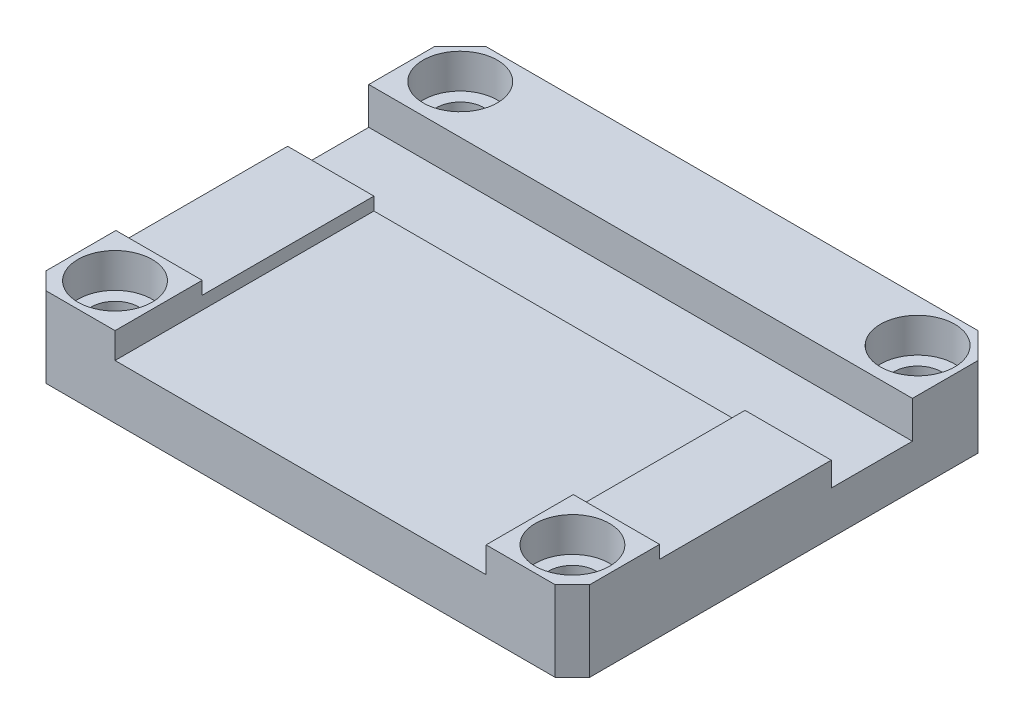
ISO-10303-21;
HEADER;
FILE_DESCRIPTION(('STEP AP214'),'2;1');
FILE_NAME('part.step','',(''),(''),'','','');
FILE_SCHEMA(('AUTOMOTIVE_DESIGN { 1 0 10303 214 1 1 1 1 }'));
ENDSEC;
DATA;
#1=APPLICATION_CONTEXT('core data for automotive mechanical design processes');
#2=APPLICATION_PROTOCOL_DEFINITION('international standard','automotive_design',2000,#1);
#3=PRODUCT_CONTEXT('',#1,'mechanical');
#4=PRODUCT('Part','Part','',(#3));
#5=PRODUCT_RELATED_PRODUCT_CATEGORY('part','',(#4));
#6=PRODUCT_DEFINITION_FORMATION('','',#4);
#7=PRODUCT_DEFINITION_CONTEXT('part definition',#1,'design');
#8=PRODUCT_DEFINITION('design','',#6,#7);
#9=PRODUCT_DEFINITION_SHAPE('','',#8);
#10=(LENGTH_UNIT() NAMED_UNIT(*) SI_UNIT(.MILLI.,.METRE.));
#11=(NAMED_UNIT(*) PLANE_ANGLE_UNIT() SI_UNIT($,.RADIAN.));
#12=(NAMED_UNIT(*) SI_UNIT($,.STERADIAN.) SOLID_ANGLE_UNIT());
#13=UNCERTAINTY_MEASURE_WITH_UNIT(LENGTH_MEASURE(1.E-05),#10,'distance_accuracy_value','');
#14=(GEOMETRIC_REPRESENTATION_CONTEXT(3) GLOBAL_UNCERTAINTY_ASSIGNED_CONTEXT((#13)) GLOBAL_UNIT_ASSIGNED_CONTEXT((#10,
#11,#12)) REPRESENTATION_CONTEXT('',''));
#15=CARTESIAN_POINT('',(0.,0.,0.));
#16=DIRECTION('',(0.,0.,1.));
#17=DIRECTION('',(1.,0.,0.));
#18=AXIS2_PLACEMENT_3D('',#15,#16,#17);
#19=CARTESIAN_POINT('',(31.5,-62.9974096804572,-5.));
#20=DIRECTION('',(0.,0.,1.));
#21=DIRECTION('',(1.,0.,0.));
#22=AXIS2_PLACEMENT_3D('',#19,#20,#21);
#23=PLANE('',#22);
#24=DIRECTION('',(-1.,0.,0.));
#25=VECTOR('',#24,1.);
#26=CARTESIAN_POINT('',(31.5,7.8,-5.));
#27=LINE('',#26,#25);
#28=CARTESIAN_POINT('',(31.5,7.8,-5.));
#29=VERTEX_POINT('',#28);
#30=CARTESIAN_POINT('',(21.5,7.8,-5.));
#31=VERTEX_POINT('',#30);
#32=EDGE_CURVE('E181',#29,#31,#27,.T.);
#33=ORIENTED_EDGE('',*,*,#32,.F.);
#34=DIRECTION('',(0.,1.,0.));
#35=VECTOR('',#34,1.);
#36=CARTESIAN_POINT('',(31.5,-62.9974096804572,-5.));
#37=LINE('',#36,#35);
#38=CARTESIAN_POINT('',(31.5,5.,-5.));
#39=VERTEX_POINT('',#38);
#40=EDGE_CURVE('E567',#39,#29,#37,.T.);
#41=ORIENTED_EDGE('',*,*,#40,.F.);
#42=DIRECTION('',(1.,0.,0.));
#43=VECTOR('',#42,1.);
#44=CARTESIAN_POINT('',(31.5,5.,-5.));
#45=LINE('',#44,#43);
#46=CARTESIAN_POINT('',(-31.5,5.,-4.99999999999999));
#47=VERTEX_POINT('',#46);
#48=EDGE_CURVE('E571',#47,#39,#45,.T.);
#49=ORIENTED_EDGE('',*,*,#48,.F.);
#50=DIRECTION('',(0.,1.,0.));
#51=VECTOR('',#50,1.);
#52=CARTESIAN_POINT('',(-31.5,-62.9974096804572,-4.99999999999999));
#53=LINE('',#52,#51);
#54=CARTESIAN_POINT('',(-31.5,7.8,-4.99999999999999));
#55=VERTEX_POINT('',#54);
#56=EDGE_CURVE('E573',#47,#55,#53,.T.);
#57=ORIENTED_EDGE('',*,*,#56,.T.);
#58=DIRECTION('',(-1.,0.,0.));
#59=VECTOR('',#58,1.);
#60=CARTESIAN_POINT('',(-31.5,7.8,-4.99999999999999));
#61=LINE('',#60,#59);
#62=CARTESIAN_POINT('',(-21.5,7.8,-4.99999999999999));
#63=VERTEX_POINT('',#62);
#64=EDGE_CURVE('E588',#63,#55,#61,.T.);
#65=ORIENTED_EDGE('',*,*,#64,.F.);
#66=DIRECTION('',(0.,1.,0.));
#67=VECTOR('',#66,1.);
#68=CARTESIAN_POINT('',(-21.5,6.3,-4.99999999999999));
#69=LINE('',#68,#67);
#70=CARTESIAN_POINT('',(-21.5,6.3,-4.99999999999999));
#71=VERTEX_POINT('',#70);
#72=EDGE_CURVE('E203',#71,#63,#69,.T.);
#73=ORIENTED_EDGE('',*,*,#72,.F.);
#74=DIRECTION('',(-1.,0.,0.));
#75=VECTOR('',#74,1.);
#76=CARTESIAN_POINT('',(0.,6.3,-5.));
#77=LINE('',#76,#75);
#78=CARTESIAN_POINT('',(21.5,6.3,-5.));
#79=VERTEX_POINT('',#78);
#80=EDGE_CURVE('E12',#79,#71,#77,.T.);
#81=ORIENTED_EDGE('',*,*,#80,.F.);
#82=DIRECTION('',(0.,-1.,0.));
#83=VECTOR('',#82,1.);
#84=CARTESIAN_POINT('',(21.5,6.3,-5.));
#85=LINE('',#84,#83);
#86=EDGE_CURVE('E195',#31,#79,#85,.T.);
#87=ORIENTED_EDGE('',*,*,#86,.F.);
#88=EDGE_LOOP('',(#33,#41,#49,#57,#65,#73,#81,#87));
#89=FACE_BOUND('',#88,.T.);
#90=ADVANCED_FACE('F43',(#89),#23,.F.);
#91=CARTESIAN_POINT('',(0.,9.3,0.));
#92=DIRECTION('',(0.,-1.,0.));
#93=DIRECTION('',(0.,0.,-1.));
#94=AXIS2_PLACEMENT_3D('',#91,#92,#93);
#95=PLANE('',#94);
#96=CARTESIAN_POINT('',(-26.5,9.3,20.));
#97=DIRECTION('',(0.,1.,0.));
#98=DIRECTION('',(0.,0.,1.));
#99=AXIS2_PLACEMENT_3D('',#96,#97,#98);
#100=CIRCLE('',#99,4.29999999999999);
#101=CARTESIAN_POINT('',(-26.5,9.3,24.3));
#102=VERTEX_POINT('',#101);
#103=EDGE_CURVE('E239',#102,#102,#100,.T.);
#104=ORIENTED_EDGE('',*,*,#103,.F.);
#105=EDGE_LOOP('',(#104));
#106=FACE_BOUND('',#105,.T.);
#107=DIRECTION('',(0.,0.,1.));
#108=VECTOR('',#107,1.);
#109=CARTESIAN_POINT('',(-21.5,9.3,25.));
#110=LINE('',#109,#108);
#111=CARTESIAN_POINT('',(-21.5,9.3,14.9));
#112=VERTEX_POINT('',#111);
#113=CARTESIAN_POINT('',(-21.5,9.3,25.));
#114=VERTEX_POINT('',#113);
#115=EDGE_CURVE('E221',#112,#114,#110,.T.);
#116=ORIENTED_EDGE('',*,*,#115,.F.);
#117=DIRECTION('',(1.,0.,0.));
#118=VECTOR('',#117,1.);
#119=CARTESIAN_POINT('',(-21.5,9.3,14.9));
#120=LINE('',#119,#118);
#121=CARTESIAN_POINT('',(-31.5,9.3,14.9));
#122=VERTEX_POINT('',#121);
#123=EDGE_CURVE('E593',#122,#112,#120,.T.);
#124=ORIENTED_EDGE('',*,*,#123,.F.);
#125=DIRECTION('',(0.,0.,1.));
#126=VECTOR('',#125,1.);
#127=CARTESIAN_POINT('',(-31.5,9.3,25.));
#128=LINE('',#127,#126);
#129=CARTESIAN_POINT('',(-31.5,9.3,23.));
#130=VERTEX_POINT('',#129);
#131=EDGE_CURVE('E315',#122,#130,#128,.T.);
#132=ORIENTED_EDGE('',*,*,#131,.T.);
#133=DIRECTION('',(-0.707106781186546,0.,-0.707106781186549));
#134=VECTOR('',#133,1.);
#135=CARTESIAN_POINT('',(-29.5,9.3,25.));
#136=LINE('',#135,#134);
#137=CARTESIAN_POINT('',(-29.5,9.3,25.));
#138=VERTEX_POINT('',#137);
#139=EDGE_CURVE('E388',#130,#138,#136,.F.);
#140=ORIENTED_EDGE('',*,*,#139,.T.);
#141=DIRECTION('',(1.,0.,0.));
#142=VECTOR('',#141,1.);
#143=CARTESIAN_POINT('',(-31.5,9.3,25.));
#144=LINE('',#143,#142);
#145=EDGE_CURVE('E321',#138,#114,#144,.T.);
#146=ORIENTED_EDGE('',*,*,#145,.T.);
#147=EDGE_LOOP('',(#116,#124,#132,#140,#146));
#148=FACE_BOUND('',#147,.T.);
#149=ADVANCED_FACE('F441',(#106,#148),#95,.F.);
#150=CARTESIAN_POINT('',(26.5,9.3,20.));
#151=DIRECTION('',(0.,1.,0.));
#152=DIRECTION('',(0.,0.,1.));
#153=AXIS2_PLACEMENT_3D('',#150,#151,#152);
#154=CIRCLE('',#153,4.29999999999999);
#155=CARTESIAN_POINT('',(26.5,9.3,24.3));
#156=VERTEX_POINT('',#155);
#157=EDGE_CURVE('E257',#156,#156,#154,.T.);
#158=ORIENTED_EDGE('',*,*,#157,.F.);
#159=EDGE_LOOP('',(#158));
#160=FACE_BOUND('',#159,.T.);
#161=DIRECTION('',(0.,0.,-1.));
#162=VECTOR('',#161,1.);
#163=CARTESIAN_POINT('',(31.5,9.3,25.));
#164=LINE('',#163,#162);
#165=CARTESIAN_POINT('',(31.5,9.3,23.));
#166=VERTEX_POINT('',#165);
#167=CARTESIAN_POINT('',(31.5,9.3,14.9));
#168=VERTEX_POINT('',#167);
#169=EDGE_CURVE('E306',#166,#168,#164,.T.);
#170=ORIENTED_EDGE('',*,*,#169,.T.);
#171=DIRECTION('',(1.,0.,0.));
#172=VECTOR('',#171,1.);
#173=CARTESIAN_POINT('',(21.5,9.3,14.9));
#174=LINE('',#173,#172);
#175=CARTESIAN_POINT('',(21.5,9.3,14.9));
#176=VERTEX_POINT('',#175);
#177=EDGE_CURVE('E592',#176,#168,#174,.T.);
#178=ORIENTED_EDGE('',*,*,#177,.F.);
#179=DIRECTION('',(0.,0.,-1.));
#180=VECTOR('',#179,1.);
#181=CARTESIAN_POINT('',(21.5,9.3,-14.4));
#182=LINE('',#181,#180);
#183=CARTESIAN_POINT('',(21.5,9.3,25.));
#184=VERTEX_POINT('',#183);
#185=EDGE_CURVE('E209',#184,#176,#182,.T.);
#186=ORIENTED_EDGE('',*,*,#185,.F.);
#187=CARTESIAN_POINT('',(29.5,9.3,25.));
#188=VERTEX_POINT('',#187);
#189=EDGE_CURVE('E320',#184,#188,#144,.T.);
#190=ORIENTED_EDGE('',*,*,#189,.T.);
#191=DIRECTION('',(-0.70710678118655,0.,0.707106781186545));
#192=VECTOR('',#191,1.);
#193=CARTESIAN_POINT('',(31.5,9.3,23.));
#194=LINE('',#193,#192);
#195=EDGE_CURVE('E385',#188,#166,#194,.F.);
#196=ORIENTED_EDGE('',*,*,#195,.T.);
#197=EDGE_LOOP('',(#170,#178,#186,#190,#196));
#198=FACE_BOUND('',#197,.T.);
#199=ADVANCED_FACE('F421',(#160,#198),#95,.F.);
#200=CARTESIAN_POINT('',(31.5,9.3,25.));
#201=DIRECTION('',(-1.,0.,0.));
#202=DIRECTION('',(0.,0.,1.));
#203=AXIS2_PLACEMENT_3D('',#200,#201,#202);
#204=PLANE('',#203);
#205=DIRECTION('',(0.,0.,-1.));
#206=VECTOR('',#205,1.);
#207=CARTESIAN_POINT('',(31.5,7.8,14.9));
#208=LINE('',#207,#206);
#209=CARTESIAN_POINT('',(31.5,7.8,14.9));
#210=VERTEX_POINT('',#209);
#211=EDGE_CURVE('E68',#210,#29,#208,.T.);
#212=ORIENTED_EDGE('',*,*,#211,.F.);
#213=DIRECTION('',(0.,1.,0.));
#214=VECTOR('',#213,1.);
#215=CARTESIAN_POINT('',(31.5,7.8,14.9));
#216=LINE('',#215,#214);
#217=EDGE_CURVE('E579',#210,#168,#216,.T.);
#218=ORIENTED_EDGE('',*,*,#217,.T.);
#219=ORIENTED_EDGE('',*,*,#169,.F.);
#220=DIRECTION('',(0.,-1.,0.));
#221=VECTOR('',#220,1.);
#222=CARTESIAN_POINT('',(31.5,9.3,23.));
#223=LINE('',#222,#221);
#224=CARTESIAN_POINT('',(31.5,0.,23.));
#225=VERTEX_POINT('',#224);
#226=EDGE_CURVE('E53',#166,#225,#223,.T.);
#227=ORIENTED_EDGE('',*,*,#226,.T.);
#228=DIRECTION('',(0.,0.,-1.));
#229=VECTOR('',#228,1.);
#230=CARTESIAN_POINT('',(31.5,0.,25.));
#231=LINE('',#230,#229);
#232=CARTESIAN_POINT('',(31.5,0.,-22.));
#233=VERTEX_POINT('',#232);
#234=EDGE_CURVE('E305',#225,#233,#231,.T.);
#235=ORIENTED_EDGE('',*,*,#234,.T.);
#236=DIRECTION('',(0.,1.,0.));
#237=VECTOR('',#236,1.);
#238=CARTESIAN_POINT('',(31.5,9.3,-22.));
#239=LINE('',#238,#237);
#240=CARTESIAN_POINT('',(31.5,9.3,-22.));
#241=VERTEX_POINT('',#240);
#242=EDGE_CURVE('E353',#233,#241,#239,.T.);
#243=ORIENTED_EDGE('',*,*,#242,.T.);
#244=CARTESIAN_POINT('',(31.5,9.3,-14.4));
#245=VERTEX_POINT('',#244);
#246=EDGE_CURVE('E311',#245,#241,#164,.T.);
#247=ORIENTED_EDGE('',*,*,#246,.F.);
#248=DIRECTION('',(0.,1.,0.));
#249=VECTOR('',#248,1.);
#250=CARTESIAN_POINT('',(31.5,-62.9974096804572,-14.4));
#251=LINE('',#250,#249);
#252=CARTESIAN_POINT('',(31.5,5.,-14.4));
#253=VERTEX_POINT('',#252);
#254=EDGE_CURVE('E413',#253,#245,#251,.T.);
#255=ORIENTED_EDGE('',*,*,#254,.F.);
#256=DIRECTION('',(0.,0.,-1.));
#257=VECTOR('',#256,1.);
#258=CARTESIAN_POINT('',(31.5,5.,-14.4));
#259=LINE('',#258,#257);
#260=EDGE_CURVE('E562',#39,#253,#259,.T.);
#261=ORIENTED_EDGE('',*,*,#260,.F.);
#262=ORIENTED_EDGE('',*,*,#40,.T.);
#263=EDGE_LOOP('',(#212,#218,#219,#227,#235,#243,#247,#255,#261,#262));
#264=FACE_BOUND('',#263,.T.);
#265=ADVANCED_FACE('F396',(#264),#204,.F.);
#266=CARTESIAN_POINT('',(-31.5,9.3,-25.));
#267=DIRECTION('',(0.,0.,1.));
#268=DIRECTION('',(1.,0.,0.));
#269=AXIS2_PLACEMENT_3D('',#266,#267,#268);
#270=PLANE('',#269);
#271=DIRECTION('',(-1.,0.,0.));
#272=VECTOR('',#271,1.);
#273=CARTESIAN_POINT('',(-31.5,9.3,-25.));
#274=LINE('',#273,#272);
#275=CARTESIAN_POINT('',(28.5,9.3,-25.));
#276=VERTEX_POINT('',#275);
#277=CARTESIAN_POINT('',(-28.5,9.3,-25.));
#278=VERTEX_POINT('',#277);
#279=EDGE_CURVE('E310',#276,#278,#274,.T.);
#280=ORIENTED_EDGE('',*,*,#279,.F.);
#281=DIRECTION('',(0.,-1.,0.));
#282=VECTOR('',#281,1.);
#283=CARTESIAN_POINT('',(28.5,9.3,-25.));
#284=LINE('',#283,#282);
#285=CARTESIAN_POINT('',(28.5,0.,-25.));
#286=VERTEX_POINT('',#285);
#287=EDGE_CURVE('E342',#276,#286,#284,.T.);
#288=ORIENTED_EDGE('',*,*,#287,.T.);
#289=DIRECTION('',(-1.,0.,0.));
#290=VECTOR('',#289,1.);
#291=CARTESIAN_POINT('',(-31.5,0.,-25.));
#292=LINE('',#291,#290);
#293=CARTESIAN_POINT('',(-28.5,0.,-25.));
#294=VERTEX_POINT('',#293);
#295=EDGE_CURVE('E328',#286,#294,#292,.T.);
#296=ORIENTED_EDGE('',*,*,#295,.T.);
#297=DIRECTION('',(0.,1.,0.));
#298=VECTOR('',#297,1.);
#299=CARTESIAN_POINT('',(-28.5,9.3,-25.));
#300=LINE('',#299,#298);
#301=EDGE_CURVE('E325',#294,#278,#300,.T.);
#302=ORIENTED_EDGE('',*,*,#301,.T.);
#303=EDGE_LOOP('',(#280,#288,#296,#302));
#304=FACE_BOUND('',#303,.T.);
#305=ADVANCED_FACE('F524',(#304),#270,.F.);
#306=CARTESIAN_POINT('',(-31.5,9.3,25.));
#307=DIRECTION('',(1.,0.,0.));
#308=DIRECTION('',(0.,0.,-1.));
#309=AXIS2_PLACEMENT_3D('',#306,#307,#308);
#310=PLANE('',#309);
#311=ORIENTED_EDGE('',*,*,#131,.F.);
#312=DIRECTION('',(0.,1.,0.));
#313=VECTOR('',#312,1.);
#314=CARTESIAN_POINT('',(-31.5,7.8,14.9));
#315=LINE('',#314,#313);
#316=CARTESIAN_POINT('',(-31.5,7.8,14.9));
#317=VERTEX_POINT('',#316);
#318=EDGE_CURVE('E584',#317,#122,#315,.T.);
#319=ORIENTED_EDGE('',*,*,#318,.F.);
#320=DIRECTION('',(0.,0.,1.));
#321=VECTOR('',#320,1.);
#322=CARTESIAN_POINT('',(-31.5,7.8,14.9));
#323=LINE('',#322,#321);
#324=EDGE_CURVE('E596',#55,#317,#323,.T.);
#325=ORIENTED_EDGE('',*,*,#324,.F.);
#326=ORIENTED_EDGE('',*,*,#56,.F.);
#327=DIRECTION('',(0.,0.,1.));
#328=VECTOR('',#327,1.);
#329=CARTESIAN_POINT('',(-31.5,5.,-4.99999999999999));
#330=LINE('',#329,#328);
#331=CARTESIAN_POINT('',(-31.5,5.,-14.4));
#332=VERTEX_POINT('',#331);
#333=EDGE_CURVE('E559',#332,#47,#330,.T.);
#334=ORIENTED_EDGE('',*,*,#333,.F.);
#335=DIRECTION('',(0.,1.,0.));
#336=VECTOR('',#335,1.);
#337=CARTESIAN_POINT('',(-31.5,-62.9974096804572,-14.4));
#338=LINE('',#337,#336);
#339=CARTESIAN_POINT('',(-31.5,9.3,-14.4));
#340=VERTEX_POINT('',#339);
#341=EDGE_CURVE('E204',#332,#340,#338,.T.);
#342=ORIENTED_EDGE('',*,*,#341,.T.);
#343=CARTESIAN_POINT('',(-31.5,9.3,-22.));
#344=VERTEX_POINT('',#343);
#345=EDGE_CURVE('E316',#344,#340,#128,.T.);
#346=ORIENTED_EDGE('',*,*,#345,.F.);
#347=DIRECTION('',(0.,-1.,0.));
#348=VECTOR('',#347,1.);
#349=CARTESIAN_POINT('',(-31.5,9.3,-22.));
#350=LINE('',#349,#348);
#351=CARTESIAN_POINT('',(-31.5,0.,-22.));
#352=VERTEX_POINT('',#351);
#353=EDGE_CURVE('E363',#344,#352,#350,.T.);
#354=ORIENTED_EDGE('',*,*,#353,.T.);
#355=DIRECTION('',(0.,0.,1.));
#356=VECTOR('',#355,1.);
#357=CARTESIAN_POINT('',(-31.5,0.,25.));
#358=LINE('',#357,#356);
#359=CARTESIAN_POINT('',(-31.5,0.,23.));
#360=VERTEX_POINT('',#359);
#361=EDGE_CURVE('E332',#352,#360,#358,.T.);
#362=ORIENTED_EDGE('',*,*,#361,.T.);
#363=DIRECTION('',(0.,1.,0.));
#364=VECTOR('',#363,1.);
#365=CARTESIAN_POINT('',(-31.5,9.3,23.));
#366=LINE('',#365,#364);
#367=EDGE_CURVE('E381',#360,#130,#366,.T.);
#368=ORIENTED_EDGE('',*,*,#367,.T.);
#369=EDGE_LOOP('',(#311,#319,#325,#326,#334,#342,#346,#354,#362,#368));
#370=FACE_BOUND('',#369,.T.);
#371=ADVANCED_FACE('F521',(#370),#310,.F.);
#372=CARTESIAN_POINT('',(-31.5,9.3,25.));
#373=DIRECTION('',(0.,0.,-1.));
#374=DIRECTION('',(-1.,0.,0.));
#375=AXIS2_PLACEMENT_3D('',#372,#373,#374);
#376=PLANE('',#375);
#377=DIRECTION('',(1.,0.,0.));
#378=VECTOR('',#377,1.);
#379=CARTESIAN_POINT('',(21.5,6.3,25.));
#380=LINE('',#379,#378);
#381=CARTESIAN_POINT('',(-21.5,6.3,25.));
#382=VERTEX_POINT('',#381);
#383=CARTESIAN_POINT('',(21.5,6.3,25.));
#384=VERTEX_POINT('',#383);
#385=EDGE_CURVE('E216',#382,#384,#380,.T.);
#386=ORIENTED_EDGE('',*,*,#385,.F.);
#387=DIRECTION('',(0.,1.,0.));
#388=VECTOR('',#387,1.);
#389=CARTESIAN_POINT('',(-21.5,6.3,25.));
#390=LINE('',#389,#388);
#391=EDGE_CURVE('E235',#382,#114,#390,.T.);
#392=ORIENTED_EDGE('',*,*,#391,.T.);
#393=ORIENTED_EDGE('',*,*,#145,.F.);
#394=DIRECTION('',(0.,-1.,0.));
#395=VECTOR('',#394,1.);
#396=CARTESIAN_POINT('',(-29.5,9.3,25.));
#397=LINE('',#396,#395);
#398=CARTESIAN_POINT('',(-29.5,0.,25.));
#399=VERTEX_POINT('',#398);
#400=EDGE_CURVE('E371',#138,#399,#397,.T.);
#401=ORIENTED_EDGE('',*,*,#400,.T.);
#402=DIRECTION('',(1.,0.,0.));
#403=VECTOR('',#402,1.);
#404=CARTESIAN_POINT('',(-31.5,0.,25.));
#405=LINE('',#404,#403);
#406=CARTESIAN_POINT('',(29.5,0.,25.));
#407=VERTEX_POINT('',#406);
#408=EDGE_CURVE('E336',#399,#407,#405,.T.);
#409=ORIENTED_EDGE('',*,*,#408,.T.);
#410=DIRECTION('',(0.,1.,0.));
#411=VECTOR('',#410,1.);
#412=CARTESIAN_POINT('',(29.5,9.3,25.));
#413=LINE('',#412,#411);
#414=EDGE_CURVE('E367',#407,#188,#413,.T.);
#415=ORIENTED_EDGE('',*,*,#414,.T.);
#416=ORIENTED_EDGE('',*,*,#189,.F.);
#417=DIRECTION('',(0.,1.,0.));
#418=VECTOR('',#417,1.);
#419=CARTESIAN_POINT('',(21.5,6.3,25.));
#420=LINE('',#419,#418);
#421=EDGE_CURVE('E227',#384,#184,#420,.T.);
#422=ORIENTED_EDGE('',*,*,#421,.F.);
#423=EDGE_LOOP('',(#386,#392,#393,#401,#409,#415,#416,#422));
#424=FACE_BOUND('',#423,.T.);
#425=ADVANCED_FACE('F427',(#424),#376,.F.);
#426=CARTESIAN_POINT('',(26.5,9.3,-20.));
#427=DIRECTION('',(0.,1.,0.));
#428=DIRECTION('',(0.,0.,1.));
#429=AXIS2_PLACEMENT_3D('',#426,#427,#428);
#430=CIRCLE('',#429,4.29999999999999);
#431=CARTESIAN_POINT('',(26.5,9.3,-15.7));
#432=VERTEX_POINT('',#431);
#433=EDGE_CURVE('E273',#432,#432,#430,.T.);
#434=ORIENTED_EDGE('',*,*,#433,.F.);
#435=EDGE_LOOP('',(#434));
#436=FACE_BOUND('',#435,.T.);
#437=CARTESIAN_POINT('',(-26.5,9.3,-20.));
#438=DIRECTION('',(0.,1.,0.));
#439=DIRECTION('',(0.,0.,1.));
#440=AXIS2_PLACEMENT_3D('',#437,#438,#439);
#441=CIRCLE('',#440,4.29999999999999);
#442=CARTESIAN_POINT('',(-26.5,9.3,-15.7));
#443=VERTEX_POINT('',#442);
#444=EDGE_CURVE('E289',#443,#443,#441,.T.);
#445=ORIENTED_EDGE('',*,*,#444,.F.);
#446=EDGE_LOOP('',(#445));
#447=FACE_BOUND('',#446,.T.);
#448=ORIENTED_EDGE('',*,*,#345,.T.);
#449=DIRECTION('',(-1.,0.,0.));
#450=VECTOR('',#449,1.);
#451=CARTESIAN_POINT('',(-21.5,9.3,-14.4));
#452=LINE('',#451,#450);
#453=EDGE_CURVE('E230',#245,#340,#452,.T.);
#454=ORIENTED_EDGE('',*,*,#453,.F.);
#455=ORIENTED_EDGE('',*,*,#246,.T.);
#456=DIRECTION('',(0.707106781186546,0.,0.707106781186549));
#457=VECTOR('',#456,1.);
#458=CARTESIAN_POINT('',(28.5,9.3,-25.));
#459=LINE('',#458,#457);
#460=EDGE_CURVE('E360',#241,#276,#459,.F.);
#461=ORIENTED_EDGE('',*,*,#460,.T.);
#462=ORIENTED_EDGE('',*,*,#279,.T.);
#463=DIRECTION('',(0.70710678118655,0.,-0.707106781186546));
#464=VECTOR('',#463,1.);
#465=CARTESIAN_POINT('',(-31.5,9.3,-22.));
#466=LINE('',#465,#464);
#467=EDGE_CURVE('E357',#278,#344,#466,.F.);
#468=ORIENTED_EDGE('',*,*,#467,.T.);
#469=EDGE_LOOP('',(#448,#454,#455,#461,#462,#468));
#470=FACE_BOUND('',#469,.T.);
#471=ADVANCED_FACE('F448',(#436,#447,#470),#95,.F.);
#472=CARTESIAN_POINT('',(0.,0.,0.));
#473=DIRECTION('',(0.,-1.,0.));
#474=DIRECTION('',(0.,0.,-1.));
#475=AXIS2_PLACEMENT_3D('',#472,#473,#474);
#476=PLANE('',#475);
#477=CARTESIAN_POINT('',(-26.5,0.,20.));
#478=DIRECTION('',(0.,1.,0.));
#479=DIRECTION('',(0.,0.,1.));
#480=AXIS2_PLACEMENT_3D('',#477,#478,#479);
#481=CIRCLE('',#480,2.75);
#482=CARTESIAN_POINT('',(-26.5,0.,22.75));
#483=VERTEX_POINT('',#482);
#484=EDGE_CURVE('E253',#483,#483,#481,.T.);
#485=ORIENTED_EDGE('',*,*,#484,.T.);
#486=EDGE_LOOP('',(#485));
#487=FACE_BOUND('',#486,.T.);
#488=CARTESIAN_POINT('',(26.5,0.,20.));
#489=DIRECTION('',(0.,1.,0.));
#490=DIRECTION('',(0.,0.,1.));
#491=AXIS2_PLACEMENT_3D('',#488,#489,#490);
#492=CIRCLE('',#491,2.75);
#493=CARTESIAN_POINT('',(26.5,0.,22.75));
#494=VERTEX_POINT('',#493);
#495=EDGE_CURVE('E269',#494,#494,#492,.T.);
#496=ORIENTED_EDGE('',*,*,#495,.T.);
#497=EDGE_LOOP('',(#496));
#498=FACE_BOUND('',#497,.T.);
#499=CARTESIAN_POINT('',(26.5,0.,-20.));
#500=DIRECTION('',(0.,1.,0.));
#501=DIRECTION('',(0.,0.,1.));
#502=AXIS2_PLACEMENT_3D('',#499,#500,#501);
#503=CIRCLE('',#502,2.75);
#504=CARTESIAN_POINT('',(26.5,0.,-17.25));
#505=VERTEX_POINT('',#504);
#506=EDGE_CURVE('E285',#505,#505,#503,.T.);
#507=ORIENTED_EDGE('',*,*,#506,.T.);
#508=EDGE_LOOP('',(#507));
#509=FACE_BOUND('',#508,.T.);
#510=CARTESIAN_POINT('',(-26.5,0.,-20.));
#511=DIRECTION('',(0.,1.,0.));
#512=DIRECTION('',(0.,0.,1.));
#513=AXIS2_PLACEMENT_3D('',#510,#511,#512);
#514=CIRCLE('',#513,2.75);
#515=CARTESIAN_POINT('',(-26.5,0.,-17.25));
#516=VERTEX_POINT('',#515);
#517=EDGE_CURVE('E301',#516,#516,#514,.T.);
#518=ORIENTED_EDGE('',*,*,#517,.T.);
#519=EDGE_LOOP('',(#518));
#520=FACE_BOUND('',#519,.T.);
#521=ORIENTED_EDGE('',*,*,#408,.F.);
#522=DIRECTION('',(0.707106781186546,0.,0.707106781186549));
#523=VECTOR('',#522,1.);
#524=CARTESIAN_POINT('',(-27.2500000000001,0.,27.25));
#525=LINE('',#524,#523);
#526=EDGE_CURVE('E378',#399,#360,#525,.F.);
#527=ORIENTED_EDGE('',*,*,#526,.T.);
#528=ORIENTED_EDGE('',*,*,#361,.F.);
#529=DIRECTION('',(-0.70710678118655,0.,0.707106781186546));
#530=VECTOR('',#529,1.);
#531=CARTESIAN_POINT('',(-26.7499999999999,0.,-26.7500000000001));
#532=LINE('',#531,#530);
#533=EDGE_CURVE('E346',#352,#294,#532,.F.);
#534=ORIENTED_EDGE('',*,*,#533,.T.);
#535=ORIENTED_EDGE('',*,*,#295,.F.);
#536=DIRECTION('',(-0.707106781186546,0.,-0.707106781186549));
#537=VECTOR('',#536,1.);
#538=CARTESIAN_POINT('',(26.7500000000001,0.,-26.7499999999999));
#539=LINE('',#538,#537);
#540=EDGE_CURVE('E349',#286,#233,#539,.F.);
#541=ORIENTED_EDGE('',*,*,#540,.T.);
#542=ORIENTED_EDGE('',*,*,#234,.F.);
#543=DIRECTION('',(0.70710678118655,0.,-0.707106781186545));
#544=VECTOR('',#543,1.);
#545=CARTESIAN_POINT('',(27.2499999999999,0.,27.2500000000001));
#546=LINE('',#545,#544);
#547=EDGE_CURVE('E375',#225,#407,#546,.F.);
#548=ORIENTED_EDGE('',*,*,#547,.T.);
#549=EDGE_LOOP('',(#521,#527,#528,#534,#535,#541,#542,#548));
#550=FACE_BOUND('',#549,.T.);
#551=ADVANCED_FACE('F402',(#487,#498,#509,#520,#550),#476,.T.);
#552=CARTESIAN_POINT('',(-26.5,9.3,-20.));
#553=DIRECTION('',(0.,1.,0.));
#554=DIRECTION('',(0.,0.,1.));
#555=AXIS2_PLACEMENT_3D('',#552,#553,#554);
#556=CYLINDRICAL_SURFACE('',#555,2.75);
#557=ORIENTED_EDGE('',*,*,#517,.F.);
#558=EDGE_LOOP('',(#557));
#559=FACE_BOUND('',#558,.T.);
#560=CARTESIAN_POINT('',(-26.5,5.3,-20.));
#561=DIRECTION('',(0.,1.,0.));
#562=DIRECTION('',(0.,0.,1.));
#563=AXIS2_PLACEMENT_3D('',#560,#561,#562);
#564=CIRCLE('',#563,2.75);
#565=CARTESIAN_POINT('',(-26.5,5.3,-17.25));
#566=VERTEX_POINT('',#565);
#567=EDGE_CURVE('E297',#566,#566,#564,.T.);
#568=ORIENTED_EDGE('',*,*,#567,.T.);
#569=EDGE_LOOP('',(#568));
#570=FACE_BOUND('',#569,.T.);
#571=ADVANCED_FACE('F509',(#559,#570),#556,.F.);
#572=CARTESIAN_POINT('',(-23.75,5.3,-20.));
#573=DIRECTION('',(0.,-1.,0.));
#574=DIRECTION('',(0.,0.,-1.));
#575=AXIS2_PLACEMENT_3D('',#572,#573,#574);
#576=PLANE('',#575);
#577=ORIENTED_EDGE('',*,*,#567,.F.);
#578=EDGE_LOOP('',(#577));
#579=FACE_BOUND('',#578,.T.);
#580=CARTESIAN_POINT('',(-26.5,5.3,-20.));
#581=DIRECTION('',(0.,1.,0.));
#582=DIRECTION('',(0.,0.,1.));
#583=AXIS2_PLACEMENT_3D('',#580,#581,#582);
#584=CIRCLE('',#583,4.3);
#585=CARTESIAN_POINT('',(-26.5,5.3,-15.7));
#586=VERTEX_POINT('',#585);
#587=EDGE_CURVE('E293',#586,#586,#584,.T.);
#588=ORIENTED_EDGE('',*,*,#587,.T.);
#589=EDGE_LOOP('',(#588));
#590=FACE_BOUND('',#589,.T.);
#591=ADVANCED_FACE('F505',(#579,#590),#576,.F.);
#592=CARTESIAN_POINT('',(-26.5,9.3,-20.));
#593=DIRECTION('',(0.,1.,0.));
#594=DIRECTION('',(0.,0.,1.));
#595=AXIS2_PLACEMENT_3D('',#592,#593,#594);
#596=CYLINDRICAL_SURFACE('',#595,4.3);
#597=ORIENTED_EDGE('',*,*,#587,.F.);
#598=EDGE_LOOP('',(#597));
#599=FACE_BOUND('',#598,.T.);
#600=ORIENTED_EDGE('',*,*,#444,.T.);
#601=EDGE_LOOP('',(#600));
#602=FACE_BOUND('',#601,.T.);
#603=ADVANCED_FACE('F501',(#599,#602),#596,.F.);
#604=CARTESIAN_POINT('',(26.5,9.3,-20.));
#605=DIRECTION('',(0.,1.,0.));
#606=DIRECTION('',(0.,0.,1.));
#607=AXIS2_PLACEMENT_3D('',#604,#605,#606);
#608=CYLINDRICAL_SURFACE('',#607,2.75);
#609=ORIENTED_EDGE('',*,*,#506,.F.);
#610=EDGE_LOOP('',(#609));
#611=FACE_BOUND('',#610,.T.);
#612=CARTESIAN_POINT('',(26.5,5.3,-20.));
#613=DIRECTION('',(0.,1.,0.));
#614=DIRECTION('',(0.,0.,1.));
#615=AXIS2_PLACEMENT_3D('',#612,#613,#614);
#616=CIRCLE('',#615,2.75);
#617=CARTESIAN_POINT('',(26.5,5.3,-17.25));
#618=VERTEX_POINT('',#617);
#619=EDGE_CURVE('E281',#618,#618,#616,.T.);
#620=ORIENTED_EDGE('',*,*,#619,.T.);
#621=EDGE_LOOP('',(#620));
#622=FACE_BOUND('',#621,.T.);
#623=ADVANCED_FACE('F497',(#611,#622),#608,.F.);
#624=CARTESIAN_POINT('',(29.25,5.3,-20.));
#625=DIRECTION('',(0.,-1.,0.));
#626=DIRECTION('',(0.,0.,-1.));
#627=AXIS2_PLACEMENT_3D('',#624,#625,#626);
#628=PLANE('',#627);
#629=ORIENTED_EDGE('',*,*,#619,.F.);
#630=EDGE_LOOP('',(#629));
#631=FACE_BOUND('',#630,.T.);
#632=CARTESIAN_POINT('',(26.5,5.3,-20.));
#633=DIRECTION('',(0.,1.,0.));
#634=DIRECTION('',(0.,0.,1.));
#635=AXIS2_PLACEMENT_3D('',#632,#633,#634);
#636=CIRCLE('',#635,4.3);
#637=CARTESIAN_POINT('',(26.5,5.3,-15.7));
#638=VERTEX_POINT('',#637);
#639=EDGE_CURVE('E277',#638,#638,#636,.T.);
#640=ORIENTED_EDGE('',*,*,#639,.T.);
#641=EDGE_LOOP('',(#640));
#642=FACE_BOUND('',#641,.T.);
#643=ADVANCED_FACE('F493',(#631,#642),#628,.F.);
#644=CARTESIAN_POINT('',(26.5,9.3,-20.));
#645=DIRECTION('',(0.,1.,0.));
#646=DIRECTION('',(0.,0.,1.));
#647=AXIS2_PLACEMENT_3D('',#644,#645,#646);
#648=CYLINDRICAL_SURFACE('',#647,4.3);
#649=ORIENTED_EDGE('',*,*,#639,.F.);
#650=EDGE_LOOP('',(#649));
#651=FACE_BOUND('',#650,.T.);
#652=ORIENTED_EDGE('',*,*,#433,.T.);
#653=EDGE_LOOP('',(#652));
#654=FACE_BOUND('',#653,.T.);
#655=ADVANCED_FACE('F489',(#651,#654),#648,.F.);
#656=CARTESIAN_POINT('',(26.5,9.3,20.));
#657=DIRECTION('',(0.,1.,0.));
#658=DIRECTION('',(0.,0.,1.));
#659=AXIS2_PLACEMENT_3D('',#656,#657,#658);
#660=CYLINDRICAL_SURFACE('',#659,2.75);
#661=ORIENTED_EDGE('',*,*,#495,.F.);
#662=EDGE_LOOP('',(#661));
#663=FACE_BOUND('',#662,.T.);
#664=CARTESIAN_POINT('',(26.5,5.3,20.));
#665=DIRECTION('',(0.,1.,0.));
#666=DIRECTION('',(0.,0.,1.));
#667=AXIS2_PLACEMENT_3D('',#664,#665,#666);
#668=CIRCLE('',#667,2.75000000000001);
#669=CARTESIAN_POINT('',(26.5,5.3,22.75));
#670=VERTEX_POINT('',#669);
#671=EDGE_CURVE('E265',#670,#670,#668,.T.);
#672=ORIENTED_EDGE('',*,*,#671,.T.);
#673=EDGE_LOOP('',(#672));
#674=FACE_BOUND('',#673,.T.);
#675=ADVANCED_FACE('F485',(#663,#674),#660,.F.);
#676=CARTESIAN_POINT('',(29.25,5.3,20.));
#677=DIRECTION('',(0.,-1.,0.));
#678=DIRECTION('',(0.,0.,-1.));
#679=AXIS2_PLACEMENT_3D('',#676,#677,#678);
#680=PLANE('',#679);
#681=ORIENTED_EDGE('',*,*,#671,.F.);
#682=EDGE_LOOP('',(#681));
#683=FACE_BOUND('',#682,.T.);
#684=CARTESIAN_POINT('',(26.5,5.3,20.));
#685=DIRECTION('',(0.,1.,0.));
#686=DIRECTION('',(0.,0.,1.));
#687=AXIS2_PLACEMENT_3D('',#684,#685,#686);
#688=CIRCLE('',#687,4.29999999999999);
#689=CARTESIAN_POINT('',(26.5,5.3,24.3));
#690=VERTEX_POINT('',#689);
#691=EDGE_CURVE('E261',#690,#690,#688,.T.);
#692=ORIENTED_EDGE('',*,*,#691,.T.);
#693=EDGE_LOOP('',(#692));
#694=FACE_BOUND('',#693,.T.);
#695=ADVANCED_FACE('F481',(#683,#694),#680,.F.);
#696=CARTESIAN_POINT('',(26.5,9.3,20.));
#697=DIRECTION('',(0.,1.,0.));
#698=DIRECTION('',(0.,0.,1.));
#699=AXIS2_PLACEMENT_3D('',#696,#697,#698);
#700=CYLINDRICAL_SURFACE('',#699,4.29999999999999);
#701=ORIENTED_EDGE('',*,*,#691,.F.);
#702=EDGE_LOOP('',(#701));
#703=FACE_BOUND('',#702,.T.);
#704=ORIENTED_EDGE('',*,*,#157,.T.);
#705=EDGE_LOOP('',(#704));
#706=FACE_BOUND('',#705,.T.);
#707=ADVANCED_FACE('F477',(#703,#706),#700,.F.);
#708=CARTESIAN_POINT('',(-26.5,9.3,20.));
#709=DIRECTION('',(0.,1.,0.));
#710=DIRECTION('',(0.,0.,1.));
#711=AXIS2_PLACEMENT_3D('',#708,#709,#710);
#712=CYLINDRICAL_SURFACE('',#711,2.75);
#713=ORIENTED_EDGE('',*,*,#484,.F.);
#714=EDGE_LOOP('',(#713));
#715=FACE_BOUND('',#714,.T.);
#716=CARTESIAN_POINT('',(-26.5,5.3,20.));
#717=DIRECTION('',(0.,1.,0.));
#718=DIRECTION('',(0.,0.,1.));
#719=AXIS2_PLACEMENT_3D('',#716,#717,#718);
#720=CIRCLE('',#719,2.75000000000001);
#721=CARTESIAN_POINT('',(-26.5,5.3,22.75));
#722=VERTEX_POINT('',#721);
#723=EDGE_CURVE('E249',#722,#722,#720,.T.);
#724=ORIENTED_EDGE('',*,*,#723,.T.);
#725=EDGE_LOOP('',(#724));
#726=FACE_BOUND('',#725,.T.);
#727=ADVANCED_FACE('F473',(#715,#726),#712,.F.);
#728=CARTESIAN_POINT('',(-23.75,5.3,20.));
#729=DIRECTION('',(0.,-1.,0.));
#730=DIRECTION('',(0.,0.,-1.));
#731=AXIS2_PLACEMENT_3D('',#728,#729,#730);
#732=PLANE('',#731);
#733=ORIENTED_EDGE('',*,*,#723,.F.);
#734=EDGE_LOOP('',(#733));
#735=FACE_BOUND('',#734,.T.);
#736=CARTESIAN_POINT('',(-26.5,5.3,20.));
#737=DIRECTION('',(0.,1.,0.));
#738=DIRECTION('',(0.,0.,1.));
#739=AXIS2_PLACEMENT_3D('',#736,#737,#738);
#740=CIRCLE('',#739,4.29999999999999);
#741=CARTESIAN_POINT('',(-26.5,5.3,24.3));
#742=VERTEX_POINT('',#741);
#743=EDGE_CURVE('E245',#742,#742,#740,.T.);
#744=ORIENTED_EDGE('',*,*,#743,.T.);
#745=EDGE_LOOP('',(#744));
#746=FACE_BOUND('',#745,.T.);
#747=ADVANCED_FACE('F469',(#735,#746),#732,.F.);
#748=CARTESIAN_POINT('',(-26.5,9.3,20.));
#749=DIRECTION('',(0.,1.,0.));
#750=DIRECTION('',(0.,0.,1.));
#751=AXIS2_PLACEMENT_3D('',#748,#749,#750);
#752=CYLINDRICAL_SURFACE('',#751,4.29999999999999);
#753=ORIENTED_EDGE('',*,*,#743,.F.);
#754=EDGE_LOOP('',(#753));
#755=FACE_BOUND('',#754,.T.);
#756=ORIENTED_EDGE('',*,*,#103,.T.);
#757=EDGE_LOOP('',(#756));
#758=FACE_BOUND('',#757,.T.);
#759=ADVANCED_FACE('F466',(#755,#758),#752,.F.);
#760=CARTESIAN_POINT('',(28.5,9.3,-25.));
#761=DIRECTION('',(-0.707106781186549,0.,0.707106781186546));
#762=DIRECTION('',(0.,-1.,0.));
#763=AXIS2_PLACEMENT_3D('',#760,#761,#762);
#764=PLANE('',#763);
#765=ORIENTED_EDGE('',*,*,#460,.F.);
#766=ORIENTED_EDGE('',*,*,#242,.F.);
#767=ORIENTED_EDGE('',*,*,#540,.F.);
#768=ORIENTED_EDGE('',*,*,#287,.F.);
#769=EDGE_LOOP('',(#765,#766,#767,#768));
#770=FACE_BOUND('',#769,.T.);
#771=ADVANCED_FACE('F408',(#770),#764,.F.);
#772=CARTESIAN_POINT('',(-31.5,9.3,-22.));
#773=DIRECTION('',(0.707106781186546,0.,0.70710678118655));
#774=DIRECTION('',(0.,-1.,0.));
#775=AXIS2_PLACEMENT_3D('',#772,#773,#774);
#776=PLANE('',#775);
#777=ORIENTED_EDGE('',*,*,#467,.F.);
#778=ORIENTED_EDGE('',*,*,#301,.F.);
#779=ORIENTED_EDGE('',*,*,#533,.F.);
#780=ORIENTED_EDGE('',*,*,#353,.F.);
#781=EDGE_LOOP('',(#777,#778,#779,#780));
#782=FACE_BOUND('',#781,.T.);
#783=ADVANCED_FACE('F438',(#782),#776,.F.);
#784=CARTESIAN_POINT('',(-29.5,9.3,25.));
#785=DIRECTION('',(0.707106781186549,0.,-0.707106781186546));
#786=DIRECTION('',(0.,-1.,0.));
#787=AXIS2_PLACEMENT_3D('',#784,#785,#786);
#788=PLANE('',#787);
#789=ORIENTED_EDGE('',*,*,#139,.F.);
#790=ORIENTED_EDGE('',*,*,#367,.F.);
#791=ORIENTED_EDGE('',*,*,#526,.F.);
#792=ORIENTED_EDGE('',*,*,#400,.F.);
#793=EDGE_LOOP('',(#789,#790,#791,#792));
#794=FACE_BOUND('',#793,.T.);
#795=ADVANCED_FACE('F430',(#794),#788,.F.);
#796=CARTESIAN_POINT('',(31.5,9.3,23.));
#797=DIRECTION('',(-0.707106781186545,0.,-0.70710678118655));
#798=DIRECTION('',(0.,-1.,0.));
#799=AXIS2_PLACEMENT_3D('',#796,#797,#798);
#800=PLANE('',#799);
#801=ORIENTED_EDGE('',*,*,#195,.F.);
#802=ORIENTED_EDGE('',*,*,#414,.F.);
#803=ORIENTED_EDGE('',*,*,#547,.F.);
#804=ORIENTED_EDGE('',*,*,#226,.F.);
#805=EDGE_LOOP('',(#801,#802,#803,#804));
#806=FACE_BOUND('',#805,.T.);
#807=ADVANCED_FACE('F46',(#806),#800,.F.);
#808=CARTESIAN_POINT('',(-21.5,6.3,25.));
#809=DIRECTION('',(-1.,0.,0.));
#810=DIRECTION('',(0.,0.,1.));
#811=AXIS2_PLACEMENT_3D('',#808,#809,#810);
#812=PLANE('',#811);
#813=DIRECTION('',(0.,0.,-1.));
#814=VECTOR('',#813,1.);
#815=CARTESIAN_POINT('',(-21.5,7.8,-4.99999999999999));
#816=LINE('',#815,#814);
#817=CARTESIAN_POINT('',(-21.5,7.8,14.9));
#818=VERTEX_POINT('',#817);
#819=EDGE_CURVE('E60',#818,#63,#816,.T.);
#820=ORIENTED_EDGE('',*,*,#819,.F.);
#821=DIRECTION('',(0.,1.,0.));
#822=VECTOR('',#821,1.);
#823=CARTESIAN_POINT('',(-21.5,7.8,14.9));
#824=LINE('',#823,#822);
#825=EDGE_CURVE('E587',#818,#112,#824,.T.);
#826=ORIENTED_EDGE('',*,*,#825,.T.);
#827=ORIENTED_EDGE('',*,*,#115,.T.);
#828=ORIENTED_EDGE('',*,*,#391,.F.);
#829=DIRECTION('',(0.,0.,1.));
#830=VECTOR('',#829,1.);
#831=CARTESIAN_POINT('',(-21.5,6.3,25.));
#832=LINE('',#831,#830);
#833=EDGE_CURVE('E224',#71,#382,#832,.T.);
#834=ORIENTED_EDGE('',*,*,#833,.F.);
#835=ORIENTED_EDGE('',*,*,#72,.T.);
#836=EDGE_LOOP('',(#820,#826,#827,#828,#834,#835));
#837=FACE_BOUND('',#836,.T.);
#838=ADVANCED_FACE('F429',(#837),#812,.F.);
#839=CARTESIAN_POINT('',(-21.5,6.3,-14.4));
#840=DIRECTION('',(0.,0.,-1.));
#841=DIRECTION('',(-1.,0.,0.));
#842=AXIS2_PLACEMENT_3D('',#839,#840,#841);
#843=PLANE('',#842);
#844=ORIENTED_EDGE('',*,*,#453,.T.);
#845=ORIENTED_EDGE('',*,*,#341,.F.);
#846=DIRECTION('',(-1.,0.,0.));
#847=VECTOR('',#846,1.);
#848=CARTESIAN_POINT('',(-21.5,5.,-14.4));
#849=LINE('',#848,#847);
#850=EDGE_CURVE('E212',#253,#332,#849,.T.);
#851=ORIENTED_EDGE('',*,*,#850,.F.);
#852=ORIENTED_EDGE('',*,*,#254,.T.);
#853=EDGE_LOOP('',(#844,#845,#851,#852));
#854=FACE_BOUND('',#853,.T.);
#855=ADVANCED_FACE('F435',(#854),#843,.F.);
#856=CARTESIAN_POINT('',(21.5,6.3,-14.4));
#857=DIRECTION('',(1.,0.,0.));
#858=DIRECTION('',(0.,0.,-1.));
#859=AXIS2_PLACEMENT_3D('',#856,#857,#858);
#860=PLANE('',#859);
#861=ORIENTED_EDGE('',*,*,#185,.T.);
#862=DIRECTION('',(0.,1.,0.));
#863=VECTOR('',#862,1.);
#864=CARTESIAN_POINT('',(21.5,7.8,14.9));
#865=LINE('',#864,#863);
#866=CARTESIAN_POINT('',(21.5,7.8,14.9));
#867=VERTEX_POINT('',#866);
#868=EDGE_CURVE('E197',#867,#176,#865,.T.);
#869=ORIENTED_EDGE('',*,*,#868,.F.);
#870=DIRECTION('',(0.,0.,1.));
#871=VECTOR('',#870,1.);
#872=CARTESIAN_POINT('',(21.5,7.8,-5.));
#873=LINE('',#872,#871);
#874=EDGE_CURVE('E184',#31,#867,#873,.T.);
#875=ORIENTED_EDGE('',*,*,#874,.F.);
#876=ORIENTED_EDGE('',*,*,#86,.T.);
#877=DIRECTION('',(0.,0.,-1.));
#878=VECTOR('',#877,1.);
#879=CARTESIAN_POINT('',(21.5,6.3,-14.4));
#880=LINE('',#879,#878);
#881=EDGE_CURVE('E220',#384,#79,#880,.T.);
#882=ORIENTED_EDGE('',*,*,#881,.F.);
#883=ORIENTED_EDGE('',*,*,#421,.T.);
#884=EDGE_LOOP('',(#861,#869,#875,#876,#882,#883));
#885=FACE_BOUND('',#884,.T.);
#886=ADVANCED_FACE('F194',(#885),#860,.F.);
#887=CARTESIAN_POINT('',(0.,6.3,0.));
#888=DIRECTION('',(0.,-1.,0.));
#889=DIRECTION('',(0.,0.,-1.));
#890=AXIS2_PLACEMENT_3D('',#887,#888,#889);
#891=PLANE('',#890);
#892=ORIENTED_EDGE('',*,*,#881,.T.);
#893=ORIENTED_EDGE('',*,*,#80,.T.);
#894=ORIENTED_EDGE('',*,*,#833,.T.);
#895=ORIENTED_EDGE('',*,*,#385,.T.);
#896=EDGE_LOOP('',(#892,#893,#894,#895));
#897=FACE_BOUND('',#896,.T.);
#898=ADVANCED_FACE('F456',(#897),#891,.F.);
#899=CARTESIAN_POINT('',(0.,5.,0.));
#900=DIRECTION('',(0.,-1.,0.));
#901=DIRECTION('',(0.,0.,-1.));
#902=AXIS2_PLACEMENT_3D('',#899,#900,#901);
#903=PLANE('',#902);
#904=ORIENTED_EDGE('',*,*,#850,.T.);
#905=ORIENTED_EDGE('',*,*,#333,.T.);
#906=ORIENTED_EDGE('',*,*,#48,.T.);
#907=ORIENTED_EDGE('',*,*,#260,.T.);
#908=EDGE_LOOP('',(#904,#905,#906,#907));
#909=FACE_BOUND('',#908,.T.);
#910=ADVANCED_FACE('F453',(#909),#903,.F.);
#911=CARTESIAN_POINT('',(-21.5,7.8,14.9));
#912=DIRECTION('',(0.,0.,1.));
#913=DIRECTION('',(1.,0.,0.));
#914=AXIS2_PLACEMENT_3D('',#911,#912,#913);
#915=PLANE('',#914);
#916=ORIENTED_EDGE('',*,*,#123,.T.);
#917=ORIENTED_EDGE('',*,*,#825,.F.);
#918=DIRECTION('',(1.,0.,0.));
#919=VECTOR('',#918,1.);
#920=CARTESIAN_POINT('',(-21.5,7.8,14.9));
#921=LINE('',#920,#919);
#922=EDGE_CURVE('E601',#317,#818,#921,.T.);
#923=ORIENTED_EDGE('',*,*,#922,.F.);
#924=ORIENTED_EDGE('',*,*,#318,.T.);
#925=EDGE_LOOP('',(#916,#917,#923,#924));
#926=FACE_BOUND('',#925,.T.);
#927=ADVANCED_FACE('F451',(#926),#915,.F.);
#928=CARTESIAN_POINT('',(0.,7.8,0.));
#929=DIRECTION('',(0.,-1.,0.));
#930=DIRECTION('',(0.,0.,-1.));
#931=AXIS2_PLACEMENT_3D('',#928,#929,#930);
#932=PLANE('',#931);
#933=ORIENTED_EDGE('',*,*,#324,.T.);
#934=ORIENTED_EDGE('',*,*,#922,.T.);
#935=ORIENTED_EDGE('',*,*,#819,.T.);
#936=ORIENTED_EDGE('',*,*,#64,.T.);
#937=EDGE_LOOP('',(#933,#934,#935,#936));
#938=FACE_BOUND('',#937,.T.);
#939=ADVANCED_FACE('F627',(#938),#932,.F.);
#940=CARTESIAN_POINT('',(21.5,7.8,14.9));
#941=DIRECTION('',(0.,0.,1.));
#942=DIRECTION('',(1.,0.,0.));
#943=AXIS2_PLACEMENT_3D('',#940,#941,#942);
#944=PLANE('',#943);
#945=ORIENTED_EDGE('',*,*,#177,.T.);
#946=ORIENTED_EDGE('',*,*,#217,.F.);
#947=DIRECTION('',(1.,0.,0.));
#948=VECTOR('',#947,1.);
#949=CARTESIAN_POINT('',(21.5,7.8,14.9));
#950=LINE('',#949,#948);
#951=EDGE_CURVE('E199',#867,#210,#950,.T.);
#952=ORIENTED_EDGE('',*,*,#951,.F.);
#953=ORIENTED_EDGE('',*,*,#868,.T.);
#954=EDGE_LOOP('',(#945,#946,#952,#953));
#955=FACE_BOUND('',#954,.T.);
#956=ADVANCED_FACE('F629',(#955),#944,.F.);
#957=CARTESIAN_POINT('',(0.,7.8,0.));
#958=DIRECTION('',(0.,1.,0.));
#959=DIRECTION('',(0.,0.,1.));
#960=AXIS2_PLACEMENT_3D('',#957,#958,#959);
#961=PLANE('',#960);
#962=ORIENTED_EDGE('',*,*,#211,.T.);
#963=ORIENTED_EDGE('',*,*,#32,.T.);
#964=ORIENTED_EDGE('',*,*,#874,.T.);
#965=ORIENTED_EDGE('',*,*,#951,.T.);
#966=EDGE_LOOP('',(#962,#963,#964,#965));
#967=FACE_BOUND('',#966,.T.);
#968=ADVANCED_FACE('F183',(#967),#961,.T.);
#969=CLOSED_SHELL('',(#90,#149,#199,#265,#305,#371,#425,#471,#551,#571,#591,#603,#623,#643,#655,
#675,#695,#707,#727,#747,#759,#771,#783,#795,#807,#838,#855,#886,#898,#910,#927,#939,#956,#968));
#970=MANIFOLD_SOLID_BREP('B2',#969);
#971=ADVANCED_BREP_SHAPE_REPRESENTATION('',(#18,#970),#14);
#972=SHAPE_DEFINITION_REPRESENTATION(#9,#971);
ENDSEC;
END-ISO-10303-21;
